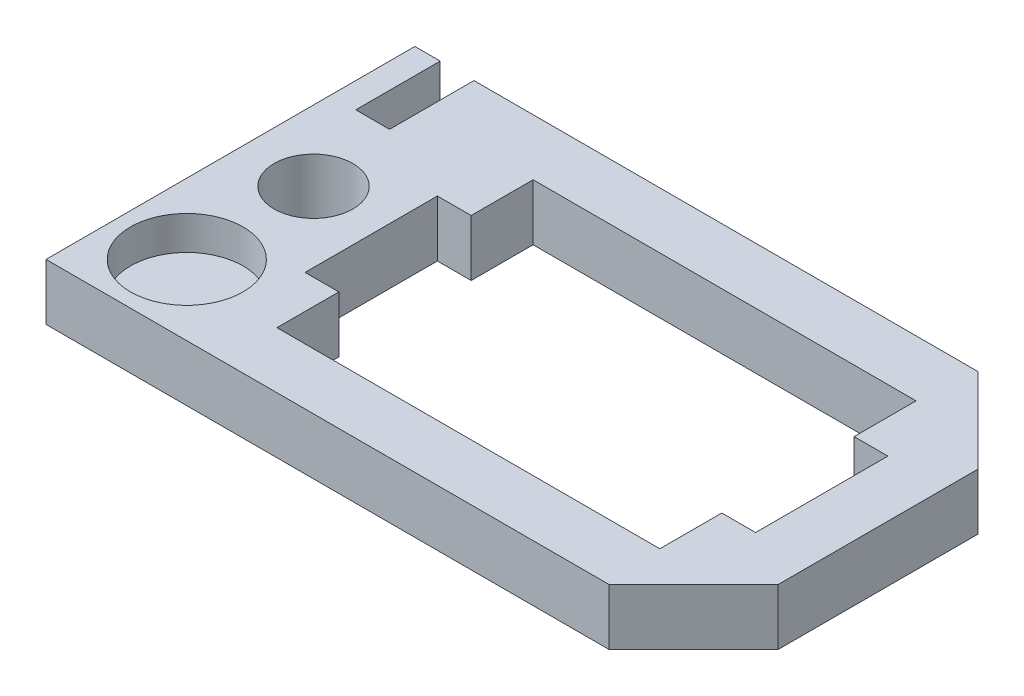
ISO-10303-21;
HEADER;
FILE_DESCRIPTION(('STEP AP214'),'2;1');
FILE_NAME('part.step','',(''),(''),'','','');
FILE_SCHEMA(('AUTOMOTIVE_DESIGN { 1 0 10303 214 1 1 1 1 }'));
ENDSEC;
DATA;
#1=APPLICATION_CONTEXT('core data for automotive mechanical design processes');
#2=APPLICATION_PROTOCOL_DEFINITION('international standard','automotive_design',2000,#1);
#3=PRODUCT_CONTEXT('',#1,'mechanical');
#4=PRODUCT('Part','Part','',(#3));
#5=PRODUCT_RELATED_PRODUCT_CATEGORY('part','',(#4));
#6=PRODUCT_DEFINITION_FORMATION('','',#4);
#7=PRODUCT_DEFINITION_CONTEXT('part definition',#1,'design');
#8=PRODUCT_DEFINITION('design','',#6,#7);
#9=PRODUCT_DEFINITION_SHAPE('','',#8);
#10=(LENGTH_UNIT() NAMED_UNIT(*) SI_UNIT(.MILLI.,.METRE.));
#11=(NAMED_UNIT(*) PLANE_ANGLE_UNIT() SI_UNIT($,.RADIAN.));
#12=(NAMED_UNIT(*) SI_UNIT($,.STERADIAN.) SOLID_ANGLE_UNIT());
#13=UNCERTAINTY_MEASURE_WITH_UNIT(LENGTH_MEASURE(1.E-05),#10,'distance_accuracy_value','');
#14=(GEOMETRIC_REPRESENTATION_CONTEXT(3) GLOBAL_UNCERTAINTY_ASSIGNED_CONTEXT((#13)) GLOBAL_UNIT_ASSIGNED_CONTEXT((#10,
#11,#12)) REPRESENTATION_CONTEXT('',''));
#15=CARTESIAN_POINT('',(0.,0.,0.));
#16=DIRECTION('',(0.,0.,1.));
#17=DIRECTION('',(1.,0.,0.));
#18=AXIS2_PLACEMENT_3D('',#15,#16,#17);
#19=CARTESIAN_POINT('',(0.,2.,-13.1));
#20=DIRECTION('',(0.,0.,-1.));
#21=DIRECTION('',(-1.,0.,0.));
#22=AXIS2_PLACEMENT_3D('',#19,#20,#21);
#23=PLANE('',#22);
#24=DIRECTION('',(0.,1.,0.));
#25=VECTOR('',#24,1.);
#26=CARTESIAN_POINT('',(0.899999999999991,2.,-13.1));
#27=LINE('',#26,#25);
#28=CARTESIAN_POINT('',(0.899999999999991,0.,-13.1));
#29=VERTEX_POINT('',#28);
#30=CARTESIAN_POINT('',(0.899999999999991,2.,-13.1));
#31=VERTEX_POINT('',#30);
#32=EDGE_CURVE('E197',#29,#31,#27,.T.);
#33=ORIENTED_EDGE('',*,*,#32,.F.);
#34=DIRECTION('',(1.,0.,0.));
#35=VECTOR('',#34,1.);
#36=CARTESIAN_POINT('',(0.,0.,-13.1));
#37=LINE('',#36,#35);
#38=CARTESIAN_POINT('',(0.,0.,-13.1));
#39=VERTEX_POINT('',#38);
#40=EDGE_CURVE('E304',#39,#29,#37,.T.);
#41=ORIENTED_EDGE('',*,*,#40,.F.);
#42=DIRECTION('',(0.,-1.,0.));
#43=VECTOR('',#42,1.);
#44=CARTESIAN_POINT('',(0.,2.,-13.1));
#45=LINE('',#44,#43);
#46=CARTESIAN_POINT('',(0.,2.,-13.1));
#47=VERTEX_POINT('',#46);
#48=EDGE_CURVE('E318',#47,#39,#45,.T.);
#49=ORIENTED_EDGE('',*,*,#48,.F.);
#50=DIRECTION('',(1.,0.,0.));
#51=VECTOR('',#50,1.);
#52=CARTESIAN_POINT('',(0.,2.,-13.1));
#53=LINE('',#52,#51);
#54=EDGE_CURVE('E263',#47,#31,#53,.T.);
#55=ORIENTED_EDGE('',*,*,#54,.T.);
#56=EDGE_LOOP('',(#33,#41,#49,#55));
#57=FACE_BOUND('',#56,.T.);
#58=ADVANCED_FACE('F41',(#57),#23,.T.);
#59=DIRECTION('',(0.,-1.,0.));
#60=VECTOR('',#59,1.);
#61=CARTESIAN_POINT('',(2.09999999999999,2.,-13.1));
#62=LINE('',#61,#60);
#63=CARTESIAN_POINT('',(2.09999999999999,2.,-13.1));
#64=VERTEX_POINT('',#63);
#65=CARTESIAN_POINT('',(2.09999999999999,0.,-13.1));
#66=VERTEX_POINT('',#65);
#67=EDGE_CURVE('E210',#64,#66,#62,.T.);
#68=ORIENTED_EDGE('',*,*,#67,.F.);
#69=CARTESIAN_POINT('',(20.,2.,-13.1));
#70=VERTEX_POINT('',#69);
#71=EDGE_CURVE('E64',#64,#70,#53,.T.);
#72=ORIENTED_EDGE('',*,*,#71,.T.);
#73=DIRECTION('',(0.,-1.,0.));
#74=VECTOR('',#73,1.);
#75=CARTESIAN_POINT('',(20.,0.,-13.1));
#76=LINE('',#75,#74);
#77=CARTESIAN_POINT('',(20.,0.,-13.1));
#78=VERTEX_POINT('',#77);
#79=EDGE_CURVE('E11',#70,#78,#76,.T.);
#80=ORIENTED_EDGE('',*,*,#79,.T.);
#81=EDGE_CURVE('E303',#66,#78,#37,.T.);
#82=ORIENTED_EDGE('',*,*,#81,.F.);
#83=EDGE_LOOP('',(#68,#72,#80,#82));
#84=FACE_BOUND('',#83,.T.);
#85=ADVANCED_FACE('F382',(#84),#23,.T.);
#86=CARTESIAN_POINT('',(0.,2.,0.));
#87=DIRECTION('',(1.,0.,0.));
#88=DIRECTION('',(0.,0.,-1.));
#89=AXIS2_PLACEMENT_3D('',#86,#87,#88);
#90=PLANE('',#89);
#91=DIRECTION('',(0.,0.,1.));
#92=VECTOR('',#91,1.);
#93=CARTESIAN_POINT('',(0.,0.,0.));
#94=LINE('',#93,#92);
#95=CARTESIAN_POINT('',(0.,0.,0.));
#96=VERTEX_POINT('',#95);
#97=EDGE_CURVE('E307',#39,#96,#94,.T.);
#98=ORIENTED_EDGE('',*,*,#97,.T.);
#99=DIRECTION('',(0.,-1.,0.));
#100=VECTOR('',#99,1.);
#101=CARTESIAN_POINT('',(0.,2.,0.));
#102=LINE('',#101,#100);
#103=CARTESIAN_POINT('',(0.,2.,0.));
#104=VERTEX_POINT('',#103);
#105=EDGE_CURVE('E315',#104,#96,#102,.T.);
#106=ORIENTED_EDGE('',*,*,#105,.F.);
#107=DIRECTION('',(0.,0.,1.));
#108=VECTOR('',#107,1.);
#109=CARTESIAN_POINT('',(0.,2.,0.));
#110=LINE('',#109,#108);
#111=EDGE_CURVE('E265',#47,#104,#110,.T.);
#112=ORIENTED_EDGE('',*,*,#111,.F.);
#113=ORIENTED_EDGE('',*,*,#48,.T.);
#114=EDGE_LOOP('',(#98,#106,#112,#113));
#115=FACE_BOUND('',#114,.T.);
#116=ADVANCED_FACE('F378',(#115),#90,.F.);
#117=CARTESIAN_POINT('',(0.,2.,0.));
#118=DIRECTION('',(0.,0.,-1.));
#119=DIRECTION('',(-1.,0.,0.));
#120=AXIS2_PLACEMENT_3D('',#117,#118,#119);
#121=PLANE('',#120);
#122=DIRECTION('',(1.,0.,0.));
#123=VECTOR('',#122,1.);
#124=CARTESIAN_POINT('',(0.,0.,0.));
#125=LINE('',#124,#123);
#126=CARTESIAN_POINT('',(20.,0.,0.));
#127=VERTEX_POINT('',#126);
#128=EDGE_CURVE('E310',#96,#127,#125,.T.);
#129=ORIENTED_EDGE('',*,*,#128,.T.);
#130=DIRECTION('',(0.,1.,0.));
#131=VECTOR('',#130,1.);
#132=CARTESIAN_POINT('',(20.,2.,0.));
#133=LINE('',#132,#131);
#134=CARTESIAN_POINT('',(20.,2.,0.));
#135=VERTEX_POINT('',#134);
#136=EDGE_CURVE('E355',#127,#135,#133,.T.);
#137=ORIENTED_EDGE('',*,*,#136,.T.);
#138=DIRECTION('',(1.,0.,0.));
#139=VECTOR('',#138,1.);
#140=CARTESIAN_POINT('',(0.,2.,0.));
#141=LINE('',#140,#139);
#142=EDGE_CURVE('E268',#104,#135,#141,.T.);
#143=ORIENTED_EDGE('',*,*,#142,.F.);
#144=ORIENTED_EDGE('',*,*,#105,.T.);
#145=EDGE_LOOP('',(#129,#137,#143,#144));
#146=FACE_BOUND('',#145,.T.);
#147=ADVANCED_FACE('F374',(#146),#121,.F.);
#148=CARTESIAN_POINT('',(0.,2.,-8.89999999999999));
#149=DIRECTION('',(0.,0.,1.));
#150=DIRECTION('',(1.,0.,0.));
#151=AXIS2_PLACEMENT_3D('',#148,#149,#150);
#152=PLANE('',#151);
#153=DIRECTION('',(-1.,0.,0.));
#154=VECTOR('',#153,1.);
#155=CARTESIAN_POINT('',(0.,0.,-8.89999999999999));
#156=LINE('',#155,#154);
#157=CARTESIAN_POINT('',(6.19999999999999,0.,-8.9));
#158=VERTEX_POINT('',#157);
#159=CARTESIAN_POINT('',(4.99999999999999,0.,-8.9));
#160=VERTEX_POINT('',#159);
#161=EDGE_CURVE('E234',#158,#160,#156,.T.);
#162=ORIENTED_EDGE('',*,*,#161,.F.);
#163=DIRECTION('',(0.,-1.,0.));
#164=VECTOR('',#163,1.);
#165=CARTESIAN_POINT('',(6.19999999999999,2.,-8.9));
#166=LINE('',#165,#164);
#167=CARTESIAN_POINT('',(6.19999999999999,2.,-8.9));
#168=VERTEX_POINT('',#167);
#169=EDGE_CURVE('E319',#168,#158,#166,.T.);
#170=ORIENTED_EDGE('',*,*,#169,.F.);
#171=DIRECTION('',(-1.,0.,0.));
#172=VECTOR('',#171,1.);
#173=CARTESIAN_POINT('',(0.,2.,-8.89999999999999));
#174=LINE('',#173,#172);
#175=CARTESIAN_POINT('',(4.99999999999999,2.,-8.9));
#176=VERTEX_POINT('',#175);
#177=EDGE_CURVE('E235',#168,#176,#174,.T.);
#178=ORIENTED_EDGE('',*,*,#177,.T.);
#179=DIRECTION('',(0.,-1.,0.));
#180=VECTOR('',#179,1.);
#181=CARTESIAN_POINT('',(4.99999999999999,2.,-8.9));
#182=LINE('',#181,#180);
#183=EDGE_CURVE('E274',#176,#160,#182,.T.);
#184=ORIENTED_EDGE('',*,*,#183,.T.);
#185=EDGE_LOOP('',(#162,#170,#178,#184));
#186=FACE_BOUND('',#185,.T.);
#187=ADVANCED_FACE('F428',(#186),#152,.T.);
#188=CARTESIAN_POINT('',(6.2,2.,0.));
#189=DIRECTION('',(1.,0.,0.));
#190=DIRECTION('',(0.,0.,-1.));
#191=AXIS2_PLACEMENT_3D('',#188,#189,#190);
#192=PLANE('',#191);
#193=DIRECTION('',(0.,0.,1.));
#194=VECTOR('',#193,1.);
#195=CARTESIAN_POINT('',(6.2,0.,0.));
#196=LINE('',#195,#194);
#197=CARTESIAN_POINT('',(6.19999999999999,0.,-11.1));
#198=VERTEX_POINT('',#197);
#199=EDGE_CURVE('E277',#198,#158,#196,.T.);
#200=ORIENTED_EDGE('',*,*,#199,.F.);
#201=DIRECTION('',(0.,-1.,0.));
#202=VECTOR('',#201,1.);
#203=CARTESIAN_POINT('',(6.19999999999999,2.,-11.1));
#204=LINE('',#203,#202);
#205=CARTESIAN_POINT('',(6.19999999999999,2.,-11.1));
#206=VERTEX_POINT('',#205);
#207=EDGE_CURVE('E344',#206,#198,#204,.T.);
#208=ORIENTED_EDGE('',*,*,#207,.F.);
#209=DIRECTION('',(0.,0.,1.));
#210=VECTOR('',#209,1.);
#211=CARTESIAN_POINT('',(6.2,2.,0.));
#212=LINE('',#211,#210);
#213=EDGE_CURVE('E238',#206,#168,#212,.T.);
#214=ORIENTED_EDGE('',*,*,#213,.T.);
#215=ORIENTED_EDGE('',*,*,#169,.T.);
#216=EDGE_LOOP('',(#200,#208,#214,#215));
#217=FACE_BOUND('',#216,.T.);
#218=ADVANCED_FACE('F403',(#217),#192,.T.);
#219=CARTESIAN_POINT('',(0.,2.,-11.1));
#220=DIRECTION('',(0.,0.,-1.));
#221=DIRECTION('',(-1.,0.,0.));
#222=AXIS2_PLACEMENT_3D('',#219,#220,#221);
#223=PLANE('',#222);
#224=DIRECTION('',(1.,0.,0.));
#225=VECTOR('',#224,1.);
#226=CARTESIAN_POINT('',(0.,0.,-11.1));
#227=LINE('',#226,#225);
#228=CARTESIAN_POINT('',(19.8,0.,-11.1));
#229=VERTEX_POINT('',#228);
#230=EDGE_CURVE('E280',#198,#229,#227,.T.);
#231=ORIENTED_EDGE('',*,*,#230,.T.);
#232=DIRECTION('',(0.,-1.,0.));
#233=VECTOR('',#232,1.);
#234=CARTESIAN_POINT('',(19.8,2.,-11.1));
#235=LINE('',#234,#233);
#236=CARTESIAN_POINT('',(19.8,2.,-11.1));
#237=VERTEX_POINT('',#236);
#238=EDGE_CURVE('E341',#237,#229,#235,.T.);
#239=ORIENTED_EDGE('',*,*,#238,.F.);
#240=DIRECTION('',(1.,0.,0.));
#241=VECTOR('',#240,1.);
#242=CARTESIAN_POINT('',(0.,2.,-11.1));
#243=LINE('',#242,#241);
#244=EDGE_CURVE('E242',#206,#237,#243,.T.);
#245=ORIENTED_EDGE('',*,*,#244,.F.);
#246=ORIENTED_EDGE('',*,*,#207,.T.);
#247=EDGE_LOOP('',(#231,#239,#245,#246));
#248=FACE_BOUND('',#247,.T.);
#249=ADVANCED_FACE('F424',(#248),#223,.F.);
#250=CARTESIAN_POINT('',(19.8,2.,0.));
#251=DIRECTION('',(1.,0.,0.));
#252=DIRECTION('',(0.,0.,-1.));
#253=AXIS2_PLACEMENT_3D('',#250,#251,#252);
#254=PLANE('',#253);
#255=DIRECTION('',(0.,0.,1.));
#256=VECTOR('',#255,1.);
#257=CARTESIAN_POINT('',(19.8,0.,0.));
#258=LINE('',#257,#256);
#259=CARTESIAN_POINT('',(19.8,0.,-8.90000000000001));
#260=VERTEX_POINT('',#259);
#261=EDGE_CURVE('E283',#229,#260,#258,.T.);
#262=ORIENTED_EDGE('',*,*,#261,.T.);
#263=DIRECTION('',(0.,-1.,0.));
#264=VECTOR('',#263,1.);
#265=CARTESIAN_POINT('',(19.8,2.,-8.90000000000001));
#266=LINE('',#265,#264);
#267=CARTESIAN_POINT('',(19.8,2.,-8.90000000000001));
#268=VERTEX_POINT('',#267);
#269=EDGE_CURVE('E338',#268,#260,#266,.T.);
#270=ORIENTED_EDGE('',*,*,#269,.F.);
#271=DIRECTION('',(0.,0.,1.));
#272=VECTOR('',#271,1.);
#273=CARTESIAN_POINT('',(19.8,2.,0.));
#274=LINE('',#273,#272);
#275=EDGE_CURVE('E245',#237,#268,#274,.T.);
#276=ORIENTED_EDGE('',*,*,#275,.F.);
#277=ORIENTED_EDGE('',*,*,#238,.T.);
#278=EDGE_LOOP('',(#262,#270,#276,#277));
#279=FACE_BOUND('',#278,.T.);
#280=ADVANCED_FACE('F412',(#279),#254,.F.);
#281=CARTESIAN_POINT('',(0.,2.,-8.90000000000001));
#282=DIRECTION('',(0.,0.,-1.));
#283=DIRECTION('',(-1.,0.,0.));
#284=AXIS2_PLACEMENT_3D('',#281,#282,#283);
#285=PLANE('',#284);
#286=DIRECTION('',(1.,0.,0.));
#287=VECTOR('',#286,1.);
#288=CARTESIAN_POINT('',(0.,0.,-8.90000000000001));
#289=LINE('',#288,#287);
#290=CARTESIAN_POINT('',(21.,0.,-8.90000000000001));
#291=VERTEX_POINT('',#290);
#292=EDGE_CURVE('E285',#260,#291,#289,.T.);
#293=ORIENTED_EDGE('',*,*,#292,.T.);
#294=DIRECTION('',(0.,-1.,0.));
#295=VECTOR('',#294,1.);
#296=CARTESIAN_POINT('',(21.,2.,-8.90000000000001));
#297=LINE('',#296,#295);
#298=CARTESIAN_POINT('',(21.,2.,-8.90000000000001));
#299=VERTEX_POINT('',#298);
#300=EDGE_CURVE('E335',#299,#291,#297,.T.);
#301=ORIENTED_EDGE('',*,*,#300,.F.);
#302=DIRECTION('',(1.,0.,0.));
#303=VECTOR('',#302,1.);
#304=CARTESIAN_POINT('',(0.,2.,-8.90000000000001));
#305=LINE('',#304,#303);
#306=EDGE_CURVE('E247',#268,#299,#305,.T.);
#307=ORIENTED_EDGE('',*,*,#306,.F.);
#308=ORIENTED_EDGE('',*,*,#269,.T.);
#309=EDGE_LOOP('',(#293,#301,#307,#308));
#310=FACE_BOUND('',#309,.T.);
#311=ADVANCED_FACE('F419',(#310),#285,.F.);
#312=CARTESIAN_POINT('',(21.,2.,0.));
#313=DIRECTION('',(1.,0.,0.));
#314=DIRECTION('',(0.,0.,-1.));
#315=AXIS2_PLACEMENT_3D('',#312,#313,#314);
#316=PLANE('',#315);
#317=DIRECTION('',(0.,0.,1.));
#318=VECTOR('',#317,1.);
#319=CARTESIAN_POINT('',(21.,0.,0.));
#320=LINE('',#319,#318);
#321=CARTESIAN_POINT('',(21.,0.,-4.20000000000001));
#322=VERTEX_POINT('',#321);
#323=EDGE_CURVE('E288',#291,#322,#320,.T.);
#324=ORIENTED_EDGE('',*,*,#323,.T.);
#325=DIRECTION('',(0.,-1.,0.));
#326=VECTOR('',#325,1.);
#327=CARTESIAN_POINT('',(21.,2.,-4.20000000000001));
#328=LINE('',#327,#326);
#329=CARTESIAN_POINT('',(21.,2.,-4.20000000000001));
#330=VERTEX_POINT('',#329);
#331=EDGE_CURVE('E333',#330,#322,#328,.T.);
#332=ORIENTED_EDGE('',*,*,#331,.F.);
#333=DIRECTION('',(0.,0.,1.));
#334=VECTOR('',#333,1.);
#335=CARTESIAN_POINT('',(21.,2.,0.));
#336=LINE('',#335,#334);
#337=EDGE_CURVE('E250',#299,#330,#336,.T.);
#338=ORIENTED_EDGE('',*,*,#337,.F.);
#339=ORIENTED_EDGE('',*,*,#300,.T.);
#340=EDGE_LOOP('',(#324,#332,#338,#339));
#341=FACE_BOUND('',#340,.T.);
#342=ADVANCED_FACE('F415',(#341),#316,.F.);
#343=CARTESIAN_POINT('',(0.,2.,-4.20000000000001));
#344=DIRECTION('',(0.,0.,-1.));
#345=DIRECTION('',(-1.,0.,0.));
#346=AXIS2_PLACEMENT_3D('',#343,#344,#345);
#347=PLANE('',#346);
#348=DIRECTION('',(1.,0.,0.));
#349=VECTOR('',#348,1.);
#350=CARTESIAN_POINT('',(0.,0.,-4.20000000000001));
#351=LINE('',#350,#349);
#352=CARTESIAN_POINT('',(19.8,0.,-4.20000000000001));
#353=VERTEX_POINT('',#352);
#354=EDGE_CURVE('E291',#353,#322,#351,.T.);
#355=ORIENTED_EDGE('',*,*,#354,.F.);
#356=DIRECTION('',(0.,-1.,0.));
#357=VECTOR('',#356,1.);
#358=CARTESIAN_POINT('',(19.8,2.,-4.20000000000001));
#359=LINE('',#358,#357);
#360=CARTESIAN_POINT('',(19.8,2.,-4.20000000000001));
#361=VERTEX_POINT('',#360);
#362=EDGE_CURVE('E331',#361,#353,#359,.T.);
#363=ORIENTED_EDGE('',*,*,#362,.F.);
#364=DIRECTION('',(1.,0.,0.));
#365=VECTOR('',#364,1.);
#366=CARTESIAN_POINT('',(0.,2.,-4.20000000000001));
#367=LINE('',#366,#365);
#368=EDGE_CURVE('E252',#361,#330,#367,.T.);
#369=ORIENTED_EDGE('',*,*,#368,.T.);
#370=ORIENTED_EDGE('',*,*,#331,.T.);
#371=EDGE_LOOP('',(#355,#363,#369,#370));
#372=FACE_BOUND('',#371,.T.);
#373=ADVANCED_FACE('F410',(#372),#347,.T.);
#374=CARTESIAN_POINT('',(19.8,0.,-2.00000000000001));
#375=VERTEX_POINT('',#374);
#376=EDGE_CURVE('E286',#353,#375,#258,.T.);
#377=ORIENTED_EDGE('',*,*,#376,.T.);
#378=DIRECTION('',(0.,-1.,0.));
#379=VECTOR('',#378,1.);
#380=CARTESIAN_POINT('',(19.8,2.,-2.00000000000001));
#381=LINE('',#380,#379);
#382=CARTESIAN_POINT('',(19.8,2.,-2.00000000000001));
#383=VERTEX_POINT('',#382);
#384=EDGE_CURVE('E329',#383,#375,#381,.T.);
#385=ORIENTED_EDGE('',*,*,#384,.F.);
#386=EDGE_CURVE('E248',#361,#383,#274,.T.);
#387=ORIENTED_EDGE('',*,*,#386,.F.);
#388=ORIENTED_EDGE('',*,*,#362,.T.);
#389=EDGE_LOOP('',(#377,#385,#387,#388));
#390=FACE_BOUND('',#389,.T.);
#391=ADVANCED_FACE('F406',(#390),#254,.F.);
#392=CARTESIAN_POINT('',(0.,2.,-2.));
#393=DIRECTION('',(0.,0.,-1.));
#394=DIRECTION('',(-1.,0.,0.));
#395=AXIS2_PLACEMENT_3D('',#392,#393,#394);
#396=PLANE('',#395);
#397=DIRECTION('',(1.,0.,0.));
#398=VECTOR('',#397,1.);
#399=CARTESIAN_POINT('',(0.,0.,-2.));
#400=LINE('',#399,#398);
#401=CARTESIAN_POINT('',(6.2,0.,-2.));
#402=VERTEX_POINT('',#401);
#403=EDGE_CURVE('E294',#402,#375,#400,.T.);
#404=ORIENTED_EDGE('',*,*,#403,.F.);
#405=DIRECTION('',(0.,-1.,0.));
#406=VECTOR('',#405,1.);
#407=CARTESIAN_POINT('',(6.2,2.,-2.));
#408=LINE('',#407,#406);
#409=CARTESIAN_POINT('',(6.2,2.,-2.));
#410=VERTEX_POINT('',#409);
#411=EDGE_CURVE('E327',#410,#402,#408,.T.);
#412=ORIENTED_EDGE('',*,*,#411,.F.);
#413=DIRECTION('',(1.,0.,0.));
#414=VECTOR('',#413,1.);
#415=CARTESIAN_POINT('',(0.,2.,-2.));
#416=LINE('',#415,#414);
#417=EDGE_CURVE('E255',#410,#383,#416,.T.);
#418=ORIENTED_EDGE('',*,*,#417,.T.);
#419=ORIENTED_EDGE('',*,*,#384,.T.);
#420=EDGE_LOOP('',(#404,#412,#418,#419));
#421=FACE_BOUND('',#420,.T.);
#422=ADVANCED_FACE('F401',(#421),#396,.T.);
#423=CARTESIAN_POINT('',(6.2,0.,-4.19999999999999));
#424=VERTEX_POINT('',#423);
#425=EDGE_CURVE('E281',#424,#402,#196,.T.);
#426=ORIENTED_EDGE('',*,*,#425,.F.);
#427=DIRECTION('',(0.,-1.,0.));
#428=VECTOR('',#427,1.);
#429=CARTESIAN_POINT('',(6.2,2.,-4.19999999999999));
#430=LINE('',#429,#428);
#431=CARTESIAN_POINT('',(6.2,2.,-4.19999999999999));
#432=VERTEX_POINT('',#431);
#433=EDGE_CURVE('E325',#432,#424,#430,.T.);
#434=ORIENTED_EDGE('',*,*,#433,.F.);
#435=EDGE_CURVE('E243',#432,#410,#212,.T.);
#436=ORIENTED_EDGE('',*,*,#435,.T.);
#437=ORIENTED_EDGE('',*,*,#411,.T.);
#438=EDGE_LOOP('',(#426,#434,#436,#437));
#439=FACE_BOUND('',#438,.T.);
#440=ADVANCED_FACE('F397',(#439),#192,.T.);
#441=CARTESIAN_POINT('',(0.,2.,-4.2));
#442=DIRECTION('',(0.,0.,1.));
#443=DIRECTION('',(1.,0.,0.));
#444=AXIS2_PLACEMENT_3D('',#441,#442,#443);
#445=PLANE('',#444);
#446=DIRECTION('',(-1.,0.,0.));
#447=VECTOR('',#446,1.);
#448=CARTESIAN_POINT('',(0.,0.,-4.2));
#449=LINE('',#448,#447);
#450=CARTESIAN_POINT('',(4.99999999999999,0.,-4.19999999999999));
#451=VERTEX_POINT('',#450);
#452=EDGE_CURVE('E297',#424,#451,#449,.T.);
#453=ORIENTED_EDGE('',*,*,#452,.T.);
#454=DIRECTION('',(0.,-1.,0.));
#455=VECTOR('',#454,1.);
#456=CARTESIAN_POINT('',(4.99999999999999,2.,-4.19999999999999));
#457=LINE('',#456,#455);
#458=CARTESIAN_POINT('',(4.99999999999999,2.,-4.19999999999999));
#459=VERTEX_POINT('',#458);
#460=EDGE_CURVE('E323',#459,#451,#457,.T.);
#461=ORIENTED_EDGE('',*,*,#460,.F.);
#462=DIRECTION('',(-1.,0.,0.));
#463=VECTOR('',#462,1.);
#464=CARTESIAN_POINT('',(0.,2.,-4.2));
#465=LINE('',#464,#463);
#466=EDGE_CURVE('E258',#432,#459,#465,.T.);
#467=ORIENTED_EDGE('',*,*,#466,.F.);
#468=ORIENTED_EDGE('',*,*,#433,.T.);
#469=EDGE_LOOP('',(#453,#461,#467,#468));
#470=FACE_BOUND('',#469,.T.);
#471=ADVANCED_FACE('F393',(#470),#445,.F.);
#472=CARTESIAN_POINT('',(5.,2.,0.));
#473=DIRECTION('',(1.,0.,0.));
#474=DIRECTION('',(0.,0.,-1.));
#475=AXIS2_PLACEMENT_3D('',#472,#473,#474);
#476=PLANE('',#475);
#477=DIRECTION('',(0.,0.,1.));
#478=VECTOR('',#477,1.);
#479=CARTESIAN_POINT('',(5.,0.,0.));
#480=LINE('',#479,#478);
#481=EDGE_CURVE('E300',#160,#451,#480,.T.);
#482=ORIENTED_EDGE('',*,*,#481,.F.);
#483=ORIENTED_EDGE('',*,*,#183,.F.);
#484=DIRECTION('',(0.,0.,1.));
#485=VECTOR('',#484,1.);
#486=CARTESIAN_POINT('',(5.,2.,0.));
#487=LINE('',#486,#485);
#488=EDGE_CURVE('E260',#176,#459,#487,.T.);
#489=ORIENTED_EDGE('',*,*,#488,.T.);
#490=ORIENTED_EDGE('',*,*,#460,.T.);
#491=EDGE_LOOP('',(#482,#483,#489,#490));
#492=FACE_BOUND('',#491,.T.);
#493=ADVANCED_FACE('F390',(#492),#476,.T.);
#494=CARTESIAN_POINT('',(23.,2.,0.));
#495=DIRECTION('',(-1.,0.,0.));
#496=DIRECTION('',(0.,0.,1.));
#497=AXIS2_PLACEMENT_3D('',#494,#495,#496);
#498=PLANE('',#497);
#499=DIRECTION('',(0.,0.,-1.));
#500=VECTOR('',#499,1.);
#501=CARTESIAN_POINT('',(23.,2.,0.));
#502=LINE('',#501,#500);
#503=CARTESIAN_POINT('',(23.,2.,-3.));
#504=VERTEX_POINT('',#503);
#505=CARTESIAN_POINT('',(23.,2.,-10.1));
#506=VERTEX_POINT('',#505);
#507=EDGE_CURVE('E271',#504,#506,#502,.T.);
#508=ORIENTED_EDGE('',*,*,#507,.F.);
#509=DIRECTION('',(0.,-1.,0.));
#510=VECTOR('',#509,1.);
#511=CARTESIAN_POINT('',(23.,2.,-3.));
#512=LINE('',#511,#510);
#513=CARTESIAN_POINT('',(23.,0.,-3.));
#514=VERTEX_POINT('',#513);
#515=EDGE_CURVE('E348',#504,#514,#512,.T.);
#516=ORIENTED_EDGE('',*,*,#515,.T.);
#517=DIRECTION('',(0.,0.,-1.));
#518=VECTOR('',#517,1.);
#519=CARTESIAN_POINT('',(23.,0.,0.));
#520=LINE('',#519,#518);
#521=CARTESIAN_POINT('',(23.,0.,-10.1));
#522=VERTEX_POINT('',#521);
#523=EDGE_CURVE('E239',#514,#522,#520,.T.);
#524=ORIENTED_EDGE('',*,*,#523,.T.);
#525=DIRECTION('',(0.,1.,0.));
#526=VECTOR('',#525,1.);
#527=CARTESIAN_POINT('',(23.,2.,-10.1));
#528=LINE('',#527,#526);
#529=EDGE_CURVE('E321',#522,#506,#528,.T.);
#530=ORIENTED_EDGE('',*,*,#529,.T.);
#531=EDGE_LOOP('',(#508,#516,#524,#530));
#532=FACE_BOUND('',#531,.T.);
#533=ADVANCED_FACE('F365',(#532),#498,.F.);
#534=CARTESIAN_POINT('',(0.,2.,0.));
#535=DIRECTION('',(0.,1.,0.));
#536=DIRECTION('',(0.,0.,1.));
#537=AXIS2_PLACEMENT_3D('',#534,#535,#536);
#538=PLANE('',#537);
#539=CARTESIAN_POINT('',(2.49999999999999,2.,-2.5));
#540=DIRECTION('',(0.,1.,0.));
#541=DIRECTION('',(0.,0.,1.));
#542=AXIS2_PLACEMENT_3D('',#539,#540,#541);
#543=CIRCLE('',#542,2.);
#544=CARTESIAN_POINT('',(2.49999999999999,2.,-0.5));
#545=VERTEX_POINT('',#544);
#546=EDGE_CURVE('E533',#545,#545,#543,.T.);
#547=ORIENTED_EDGE('',*,*,#546,.F.);
#548=EDGE_LOOP('',(#547));
#549=FACE_BOUND('',#548,.T.);
#550=DIRECTION('',(0.,0.,-1.));
#551=VECTOR('',#550,1.);
#552=CARTESIAN_POINT('',(0.899999999999992,2.,-10.1));
#553=LINE('',#552,#551);
#554=CARTESIAN_POINT('',(0.899999999999992,2.,-10.1));
#555=VERTEX_POINT('',#554);
#556=EDGE_CURVE('E192',#555,#31,#553,.T.);
#557=ORIENTED_EDGE('',*,*,#556,.T.);
#558=ORIENTED_EDGE('',*,*,#54,.F.);
#559=ORIENTED_EDGE('',*,*,#111,.T.);
#560=ORIENTED_EDGE('',*,*,#142,.T.);
#561=DIRECTION('',(-0.707106781186549,0.,0.707106781186546));
#562=VECTOR('',#561,1.);
#563=CARTESIAN_POINT('',(9.99999999999996,2.,10.));
#564=LINE('',#563,#562);
#565=EDGE_CURVE('E50',#135,#504,#564,.F.);
#566=ORIENTED_EDGE('',*,*,#565,.T.);
#567=ORIENTED_EDGE('',*,*,#507,.T.);
#568=DIRECTION('',(-0.707106781186546,0.,-0.707106781186549));
#569=VECTOR('',#568,1.);
#570=CARTESIAN_POINT('',(16.55,2.,-16.55));
#571=LINE('',#570,#569);
#572=EDGE_CURVE('E357',#506,#70,#571,.T.);
#573=ORIENTED_EDGE('',*,*,#572,.T.);
#574=ORIENTED_EDGE('',*,*,#71,.F.);
#575=DIRECTION('',(0.,0.,-1.));
#576=VECTOR('',#575,1.);
#577=CARTESIAN_POINT('',(2.09999999999999,2.,-10.1));
#578=LINE('',#577,#576);
#579=CARTESIAN_POINT('',(2.09999999999999,2.,-10.1));
#580=VERTEX_POINT('',#579);
#581=EDGE_CURVE('E202',#580,#64,#578,.T.);
#582=ORIENTED_EDGE('',*,*,#581,.F.);
#583=DIRECTION('',(1.,0.,0.));
#584=VECTOR('',#583,1.);
#585=CARTESIAN_POINT('',(0.899999999999992,2.,-10.1));
#586=LINE('',#585,#584);
#587=EDGE_CURVE('E206',#555,#580,#586,.T.);
#588=ORIENTED_EDGE('',*,*,#587,.F.);
#589=EDGE_LOOP('',(#557,#558,#559,#560,#566,#567,#573,#574,#582,#588));
#590=FACE_BOUND('',#589,.T.);
#591=CARTESIAN_POINT('',(2.49999999999999,2.,-7.));
#592=DIRECTION('',(0.,1.,0.));
#593=DIRECTION('',(0.,0.,1.));
#594=AXIS2_PLACEMENT_3D('',#591,#592,#593);
#595=CIRCLE('',#594,1.4);
#596=CARTESIAN_POINT('',(2.49999999999999,2.,-5.6));
#597=VERTEX_POINT('',#596);
#598=EDGE_CURVE('E224',#597,#597,#595,.T.);
#599=ORIENTED_EDGE('',*,*,#598,.F.);
#600=EDGE_LOOP('',(#599));
#601=FACE_BOUND('',#600,.T.);
#602=ORIENTED_EDGE('',*,*,#177,.F.);
#603=ORIENTED_EDGE('',*,*,#213,.F.);
#604=ORIENTED_EDGE('',*,*,#244,.T.);
#605=ORIENTED_EDGE('',*,*,#275,.T.);
#606=ORIENTED_EDGE('',*,*,#306,.T.);
#607=ORIENTED_EDGE('',*,*,#337,.T.);
#608=ORIENTED_EDGE('',*,*,#368,.F.);
#609=ORIENTED_EDGE('',*,*,#386,.T.);
#610=ORIENTED_EDGE('',*,*,#417,.F.);
#611=ORIENTED_EDGE('',*,*,#435,.F.);
#612=ORIENTED_EDGE('',*,*,#466,.T.);
#613=ORIENTED_EDGE('',*,*,#488,.F.);
#614=EDGE_LOOP('',(#602,#603,#604,#605,#606,#607,#608,#609,#610,#611,#612,#613));
#615=FACE_BOUND('',#614,.T.);
#616=ADVANCED_FACE('F212',(#549,#590,#601,#615),#538,.T.);
#617=CARTESIAN_POINT('',(0.,0.,0.));
#618=DIRECTION('',(0.,1.,0.));
#619=DIRECTION('',(0.,0.,1.));
#620=AXIS2_PLACEMENT_3D('',#617,#618,#619);
#621=PLANE('',#620);
#622=ORIENTED_EDGE('',*,*,#40,.T.);
#623=DIRECTION('',(0.,0.,-1.));
#624=VECTOR('',#623,1.);
#625=CARTESIAN_POINT('',(0.899999999999991,0.,-10.1));
#626=LINE('',#625,#624);
#627=CARTESIAN_POINT('',(0.899999999999991,0.,-10.1));
#628=VERTEX_POINT('',#627);
#629=EDGE_CURVE('E222',#628,#29,#626,.T.);
#630=ORIENTED_EDGE('',*,*,#629,.F.);
#631=DIRECTION('',(-1.,0.,0.));
#632=VECTOR('',#631,1.);
#633=CARTESIAN_POINT('',(0.899999999999991,0.,-10.1));
#634=LINE('',#633,#632);
#635=CARTESIAN_POINT('',(2.09999999999999,0.,-10.1));
#636=VERTEX_POINT('',#635);
#637=EDGE_CURVE('E203',#636,#628,#634,.T.);
#638=ORIENTED_EDGE('',*,*,#637,.F.);
#639=DIRECTION('',(0.,0.,-1.));
#640=VECTOR('',#639,1.);
#641=CARTESIAN_POINT('',(2.09999999999999,0.,-10.1));
#642=LINE('',#641,#640);
#643=EDGE_CURVE('E225',#636,#66,#642,.T.);
#644=ORIENTED_EDGE('',*,*,#643,.T.);
#645=ORIENTED_EDGE('',*,*,#81,.T.);
#646=DIRECTION('',(0.707106781186546,0.,0.707106781186549));
#647=VECTOR('',#646,1.);
#648=CARTESIAN_POINT('',(20.,0.,-13.1));
#649=LINE('',#648,#647);
#650=EDGE_CURVE('E351',#78,#522,#649,.T.);
#651=ORIENTED_EDGE('',*,*,#650,.T.);
#652=ORIENTED_EDGE('',*,*,#523,.F.);
#653=DIRECTION('',(0.707106781186549,0.,-0.707106781186546));
#654=VECTOR('',#653,1.);
#655=CARTESIAN_POINT('',(23.,0.,-3.));
#656=LINE('',#655,#654);
#657=EDGE_CURVE('E353',#514,#127,#656,.F.);
#658=ORIENTED_EDGE('',*,*,#657,.T.);
#659=ORIENTED_EDGE('',*,*,#128,.F.);
#660=ORIENTED_EDGE('',*,*,#97,.F.);
#661=EDGE_LOOP('',(#622,#630,#638,#644,#645,#651,#652,#658,#659,#660));
#662=FACE_BOUND('',#661,.T.);
#663=CARTESIAN_POINT('',(2.49999999999999,0.,-7.));
#664=DIRECTION('',(0.,1.,0.));
#665=DIRECTION('',(0.,0.,1.));
#666=AXIS2_PLACEMENT_3D('',#663,#664,#665);
#667=CIRCLE('',#666,1.4);
#668=CARTESIAN_POINT('',(2.49999999999999,0.,-5.6));
#669=VERTEX_POINT('',#668);
#670=EDGE_CURVE('E231',#669,#669,#667,.F.);
#671=ORIENTED_EDGE('',*,*,#670,.F.);
#672=EDGE_LOOP('',(#671));
#673=FACE_BOUND('',#672,.T.);
#674=ORIENTED_EDGE('',*,*,#161,.T.);
#675=ORIENTED_EDGE('',*,*,#481,.T.);
#676=ORIENTED_EDGE('',*,*,#452,.F.);
#677=ORIENTED_EDGE('',*,*,#425,.T.);
#678=ORIENTED_EDGE('',*,*,#403,.T.);
#679=ORIENTED_EDGE('',*,*,#376,.F.);
#680=ORIENTED_EDGE('',*,*,#354,.T.);
#681=ORIENTED_EDGE('',*,*,#323,.F.);
#682=ORIENTED_EDGE('',*,*,#292,.F.);
#683=ORIENTED_EDGE('',*,*,#261,.F.);
#684=ORIENTED_EDGE('',*,*,#230,.F.);
#685=ORIENTED_EDGE('',*,*,#199,.T.);
#686=EDGE_LOOP('',(#674,#675,#676,#677,#678,#679,#680,#681,#682,#683,#684,#685));
#687=FACE_BOUND('',#686,.T.);
#688=ADVANCED_FACE('F370',(#662,#673,#687),#621,.F.);
#689=CARTESIAN_POINT('',(2.49999999999999,-0.00100000000000013,-7.));
#690=DIRECTION('',(0.,1.,0.));
#691=DIRECTION('',(0.,0.,1.));
#692=AXIS2_PLACEMENT_3D('',#689,#690,#691);
#693=CYLINDRICAL_SURFACE('',#692,1.4);
#694=ORIENTED_EDGE('',*,*,#598,.T.);
#695=EDGE_LOOP('',(#694));
#696=FACE_BOUND('',#695,.T.);
#697=ORIENTED_EDGE('',*,*,#670,.T.);
#698=EDGE_LOOP('',(#697));
#699=FACE_BOUND('',#698,.T.);
#700=ADVANCED_FACE('F435',(#696,#699),#693,.F.);
#701=CARTESIAN_POINT('',(23.,2.,-3.));
#702=DIRECTION('',(-0.707106781186546,0.,-0.707106781186549));
#703=DIRECTION('',(0.,-1.,0.));
#704=AXIS2_PLACEMENT_3D('',#701,#702,#703);
#705=PLANE('',#704);
#706=ORIENTED_EDGE('',*,*,#565,.F.);
#707=ORIENTED_EDGE('',*,*,#136,.F.);
#708=ORIENTED_EDGE('',*,*,#657,.F.);
#709=ORIENTED_EDGE('',*,*,#515,.F.);
#710=EDGE_LOOP('',(#706,#707,#708,#709));
#711=FACE_BOUND('',#710,.T.);
#712=ADVANCED_FACE('F368',(#711),#705,.F.);
#713=CARTESIAN_POINT('',(20.,2.,-13.1));
#714=DIRECTION('',(0.707106781186549,0.,-0.707106781186546));
#715=DIRECTION('',(0.,1.,0.));
#716=AXIS2_PLACEMENT_3D('',#713,#714,#715);
#717=PLANE('',#716);
#718=ORIENTED_EDGE('',*,*,#572,.F.);
#719=ORIENTED_EDGE('',*,*,#529,.F.);
#720=ORIENTED_EDGE('',*,*,#650,.F.);
#721=ORIENTED_EDGE('',*,*,#79,.F.);
#722=EDGE_LOOP('',(#718,#719,#720,#721));
#723=FACE_BOUND('',#722,.T.);
#724=ADVANCED_FACE('F44',(#723),#717,.T.);
#725=CARTESIAN_POINT('',(0.899999999999992,2.,-10.1));
#726=DIRECTION('',(-1.,0.,0.));
#727=DIRECTION('',(0.,-1.,0.));
#728=AXIS2_PLACEMENT_3D('',#725,#726,#727);
#729=PLANE('',#728);
#730=ORIENTED_EDGE('',*,*,#32,.T.);
#731=ORIENTED_EDGE('',*,*,#556,.F.);
#732=DIRECTION('',(0.,1.,0.));
#733=VECTOR('',#732,1.);
#734=CARTESIAN_POINT('',(0.899999999999992,2.,-10.1));
#735=LINE('',#734,#733);
#736=EDGE_CURVE('E195',#628,#555,#735,.T.);
#737=ORIENTED_EDGE('',*,*,#736,.F.);
#738=ORIENTED_EDGE('',*,*,#629,.T.);
#739=EDGE_LOOP('',(#730,#731,#737,#738));
#740=FACE_BOUND('',#739,.T.);
#741=ADVANCED_FACE('F194',(#740),#729,.F.);
#742=CARTESIAN_POINT('',(2.09999999999999,2.,-10.1));
#743=DIRECTION('',(1.,0.,0.));
#744=DIRECTION('',(0.,1.,0.));
#745=AXIS2_PLACEMENT_3D('',#742,#743,#744);
#746=PLANE('',#745);
#747=ORIENTED_EDGE('',*,*,#67,.T.);
#748=ORIENTED_EDGE('',*,*,#643,.F.);
#749=DIRECTION('',(0.,-1.,0.));
#750=VECTOR('',#749,1.);
#751=CARTESIAN_POINT('',(2.09999999999999,2.,-10.1));
#752=LINE('',#751,#750);
#753=EDGE_CURVE('E57',#580,#636,#752,.T.);
#754=ORIENTED_EDGE('',*,*,#753,.F.);
#755=ORIENTED_EDGE('',*,*,#581,.T.);
#756=EDGE_LOOP('',(#747,#748,#754,#755));
#757=FACE_BOUND('',#756,.T.);
#758=ADVANCED_FACE('F486',(#757),#746,.F.);
#759=CARTESIAN_POINT('',(0.,0.,-10.1));
#760=DIRECTION('',(0.,0.,1.));
#761=DIRECTION('',(1.,0.,0.));
#762=AXIS2_PLACEMENT_3D('',#759,#760,#761);
#763=PLANE('',#762);
#764=ORIENTED_EDGE('',*,*,#736,.T.);
#765=ORIENTED_EDGE('',*,*,#587,.T.);
#766=ORIENTED_EDGE('',*,*,#753,.T.);
#767=ORIENTED_EDGE('',*,*,#637,.T.);
#768=EDGE_LOOP('',(#764,#765,#766,#767));
#769=FACE_BOUND('',#768,.T.);
#770=ADVANCED_FACE('F205',(#769),#763,.F.);
#771=CARTESIAN_POINT('',(2.49999999999999,0.8,-2.5));
#772=DIRECTION('',(0.,1.,0.));
#773=DIRECTION('',(0.,0.,1.));
#774=AXIS2_PLACEMENT_3D('',#771,#772,#773);
#775=CYLINDRICAL_SURFACE('',#774,2.);
#776=CARTESIAN_POINT('',(2.49999999999999,0.8,-2.5));
#777=DIRECTION('',(0.,1.,0.));
#778=DIRECTION('',(0.,0.,1.));
#779=AXIS2_PLACEMENT_3D('',#776,#777,#778);
#780=CIRCLE('',#779,2.);
#781=CARTESIAN_POINT('',(2.49999999999999,0.8,-0.5));
#782=VERTEX_POINT('',#781);
#783=EDGE_CURVE('E220',#782,#782,#780,.T.);
#784=ORIENTED_EDGE('',*,*,#783,.F.);
#785=EDGE_LOOP('',(#784));
#786=FACE_BOUND('',#785,.T.);
#787=ORIENTED_EDGE('',*,*,#546,.T.);
#788=EDGE_LOOP('',(#787));
#789=FACE_BOUND('',#788,.T.);
#790=ADVANCED_FACE('F502',(#786,#789),#775,.F.);
#791=CARTESIAN_POINT('',(2.49999999999999,0.8,-2.5));
#792=DIRECTION('',(0.,1.,0.));
#793=DIRECTION('',(0.,0.,1.));
#794=AXIS2_PLACEMENT_3D('',#791,#792,#793);
#795=PLANE('',#794);
#796=ORIENTED_EDGE('',*,*,#783,.T.);
#797=EDGE_LOOP('',(#796));
#798=FACE_BOUND('',#797,.T.);
#799=ADVANCED_FACE('F517',(#798),#795,.T.);
#800=CLOSED_SHELL('',(#58,#85,#116,#147,#187,#218,#249,#280,#311,#342,#373,#391,#422,#440,#471,
#493,#533,#616,#688,#700,#712,#724,#741,#758,#770,#790,#799));
#801=MANIFOLD_SOLID_BREP('B2',#800);
#802=ADVANCED_BREP_SHAPE_REPRESENTATION('',(#18,#801),#14);
#803=SHAPE_DEFINITION_REPRESENTATION(#9,#802);
ENDSEC;
END-ISO-10303-21;
